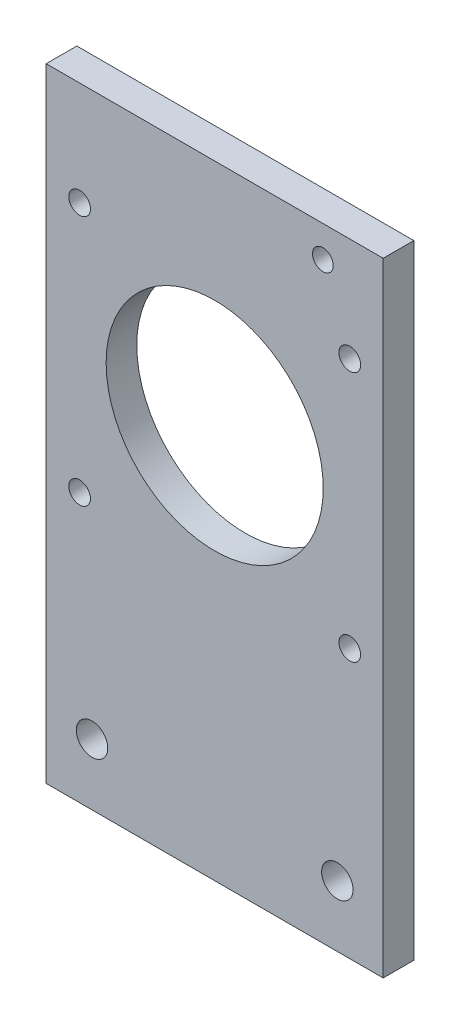
ISO-10303-21;
HEADER;
FILE_DESCRIPTION(('STEP AP214'),'2;1');
FILE_NAME('part.step','',(''),(''),'','','');
FILE_SCHEMA(('AUTOMOTIVE_DESIGN { 1 0 10303 214 1 1 1 1 }'));
ENDSEC;
DATA;
#1=APPLICATION_CONTEXT('core data for automotive mechanical design processes');
#2=APPLICATION_PROTOCOL_DEFINITION('international standard','automotive_design',2000,#1);
#3=PRODUCT_CONTEXT('',#1,'mechanical');
#4=PRODUCT('Part','Part','',(#3));
#5=PRODUCT_RELATED_PRODUCT_CATEGORY('part','',(#4));
#6=PRODUCT_DEFINITION_FORMATION('','',#4);
#7=PRODUCT_DEFINITION_CONTEXT('part definition',#1,'design');
#8=PRODUCT_DEFINITION('design','',#6,#7);
#9=PRODUCT_DEFINITION_SHAPE('','',#8);
#10=(LENGTH_UNIT() NAMED_UNIT(*) SI_UNIT(.MILLI.,.METRE.));
#11=(NAMED_UNIT(*) PLANE_ANGLE_UNIT() SI_UNIT($,.RADIAN.));
#12=(NAMED_UNIT(*) SI_UNIT($,.STERADIAN.) SOLID_ANGLE_UNIT());
#13=UNCERTAINTY_MEASURE_WITH_UNIT(LENGTH_MEASURE(1.E-05),#10,'distance_accuracy_value','');
#14=(GEOMETRIC_REPRESENTATION_CONTEXT(3) GLOBAL_UNCERTAINTY_ASSIGNED_CONTEXT((#13)) GLOBAL_UNIT_ASSIGNED_CONTEXT((#10,
#11,#12)) REPRESENTATION_CONTEXT('',''));
#15=CARTESIAN_POINT('',(0.,0.,0.));
#16=DIRECTION('',(0.,0.,1.));
#17=DIRECTION('',(1.,0.,0.));
#18=AXIS2_PLACEMENT_3D('',#15,#16,#17);
#19=CARTESIAN_POINT('',(0.,0.,3.175));
#20=DIRECTION('',(0.,0.,1.));
#21=DIRECTION('',(1.,0.,0.));
#22=AXIS2_PLACEMENT_3D('',#19,#20,#21);
#23=PLANE('',#22);
#24=CARTESIAN_POINT('',(-28.,107.7,3.175));
#25=DIRECTION('',(0.,0.,-1.));
#26=DIRECTION('',(-1.,0.,0.));
#27=AXIS2_PLACEMENT_3D('',#24,#25,#26);
#28=CIRCLE('',#27,2.25);
#29=CARTESIAN_POINT('',(-30.25,107.7,3.175));
#30=VERTEX_POINT('',#29);
#31=EDGE_CURVE('E189',#30,#30,#28,.T.);
#32=ORIENTED_EDGE('',*,*,#31,.T.);
#33=EDGE_LOOP('',(#32));
#34=FACE_BOUND('',#33,.T.);
#35=CARTESIAN_POINT('',(28.,55.7,3.175));
#36=DIRECTION('',(0.,0.,-1.));
#37=DIRECTION('',(-1.,0.,0.));
#38=AXIS2_PLACEMENT_3D('',#35,#36,#37);
#39=CIRCLE('',#38,2.25000000000001);
#40=CARTESIAN_POINT('',(25.75,55.7,3.175));
#41=VERTEX_POINT('',#40);
#42=EDGE_CURVE('E190',#41,#41,#39,.T.);
#43=ORIENTED_EDGE('',*,*,#42,.T.);
#44=EDGE_LOOP('',(#43));
#45=FACE_BOUND('',#44,.T.);
#46=CARTESIAN_POINT('',(-28.,55.7,3.175));
#47=DIRECTION('',(0.,0.,-1.));
#48=DIRECTION('',(-1.,0.,0.));
#49=AXIS2_PLACEMENT_3D('',#46,#47,#48);
#50=CIRCLE('',#49,2.25);
#51=CARTESIAN_POINT('',(-30.25,55.7,3.175));
#52=VERTEX_POINT('',#51);
#53=EDGE_CURVE('E194',#52,#52,#50,.T.);
#54=ORIENTED_EDGE('',*,*,#53,.T.);
#55=EDGE_LOOP('',(#54));
#56=FACE_BOUND('',#55,.T.);
#57=CARTESIAN_POINT('',(28.,107.7,3.175));
#58=DIRECTION('',(0.,0.,-1.));
#59=DIRECTION('',(-1.,0.,0.));
#60=AXIS2_PLACEMENT_3D('',#57,#58,#59);
#61=CIRCLE('',#60,2.25000000000001);
#62=CARTESIAN_POINT('',(25.75,107.7,3.175));
#63=VERTEX_POINT('',#62);
#64=EDGE_CURVE('E137',#63,#63,#61,.T.);
#65=ORIENTED_EDGE('',*,*,#64,.T.);
#66=EDGE_LOOP('',(#65));
#67=FACE_BOUND('',#66,.T.);
#68=CARTESIAN_POINT('',(-25.425,12.7,3.175));
#69=DIRECTION('',(0.,0.,1.));
#70=DIRECTION('',(1.,0.,0.));
#71=AXIS2_PLACEMENT_3D('',#68,#69,#70);
#72=CIRCLE('',#71,3.25755);
#73=CARTESIAN_POINT('',(-22.16745,12.7,3.175));
#74=VERTEX_POINT('',#73);
#75=EDGE_CURVE('E170',#74,#74,#72,.T.);
#76=ORIENTED_EDGE('',*,*,#75,.F.);
#77=EDGE_LOOP('',(#76));
#78=FACE_BOUND('',#77,.T.);
#79=CARTESIAN_POINT('',(25.425,12.7,3.175));
#80=DIRECTION('',(0.,0.,1.));
#81=DIRECTION('',(1.,0.,0.));
#82=AXIS2_PLACEMENT_3D('',#79,#80,#81);
#83=CIRCLE('',#82,3.25755);
#84=CARTESIAN_POINT('',(28.68255,12.7,3.175));
#85=VERTEX_POINT('',#84);
#86=EDGE_CURVE('E166',#85,#85,#83,.T.);
#87=ORIENTED_EDGE('',*,*,#86,.F.);
#88=EDGE_LOOP('',(#87));
#89=FACE_BOUND('',#88,.T.);
#90=CARTESIAN_POINT('',(22.425,122.7,3.175));
#91=DIRECTION('',(0.,0.,1.));
#92=DIRECTION('',(1.,0.,0.));
#93=AXIS2_PLACEMENT_3D('',#90,#91,#92);
#94=CIRCLE('',#93,2.15);
#95=CARTESIAN_POINT('',(24.575,122.7,3.175));
#96=VERTEX_POINT('',#95);
#97=EDGE_CURVE('E162',#96,#96,#94,.T.);
#98=ORIENTED_EDGE('',*,*,#97,.F.);
#99=EDGE_LOOP('',(#98));
#100=FACE_BOUND('',#99,.T.);
#101=DIRECTION('',(0.,-1.,0.));
#102=VECTOR('',#101,1.);
#103=CARTESIAN_POINT('',(-34.925,0.,3.175));
#104=LINE('',#103,#102);
#105=CARTESIAN_POINT('',(-34.925,129.2,3.175));
#106=VERTEX_POINT('',#105);
#107=CARTESIAN_POINT('',(-34.925,0.,3.175));
#108=VERTEX_POINT('',#107);
#109=EDGE_CURVE('E65',#106,#108,#104,.T.);
#110=ORIENTED_EDGE('',*,*,#109,.T.);
#111=DIRECTION('',(1.,0.,0.));
#112=VECTOR('',#111,1.);
#113=CARTESIAN_POINT('',(-34.925,0.,3.175));
#114=LINE('',#113,#112);
#115=CARTESIAN_POINT('',(34.925,0.,3.175));
#116=VERTEX_POINT('',#115);
#117=EDGE_CURVE('E96',#108,#116,#114,.T.);
#118=ORIENTED_EDGE('',*,*,#117,.T.);
#119=DIRECTION('',(0.,1.,0.));
#120=VECTOR('',#119,1.);
#121=CARTESIAN_POINT('',(34.925,0.,3.175));
#122=LINE('',#121,#120);
#123=CARTESIAN_POINT('',(34.925,129.2,3.175));
#124=VERTEX_POINT('',#123);
#125=EDGE_CURVE('E100',#116,#124,#122,.T.);
#126=ORIENTED_EDGE('',*,*,#125,.T.);
#127=DIRECTION('',(-1.,0.,0.));
#128=VECTOR('',#127,1.);
#129=CARTESIAN_POINT('',(34.925,129.2,3.175));
#130=LINE('',#129,#128);
#131=EDGE_CURVE('E111',#124,#106,#130,.T.);
#132=ORIENTED_EDGE('',*,*,#131,.T.);
#133=EDGE_LOOP('',(#110,#118,#126,#132));
#134=FACE_BOUND('',#133,.T.);
#135=CARTESIAN_POINT('',(0.,81.7,3.175));
#136=DIRECTION('',(0.,0.,1.));
#137=DIRECTION('',(1.,0.,0.));
#138=AXIS2_PLACEMENT_3D('',#135,#136,#137);
#139=CIRCLE('',#138,22.5);
#140=CARTESIAN_POINT('',(22.5,81.7,3.175));
#141=VERTEX_POINT('',#140);
#142=EDGE_CURVE('E120',#141,#141,#139,.T.);
#143=ORIENTED_EDGE('',*,*,#142,.F.);
#144=EDGE_LOOP('',(#143));
#145=FACE_BOUND('',#144,.T.);
#146=ADVANCED_FACE('F45',(#34,#45,#56,#67,#78,#89,#100,#134,#145),#23,.T.);
#147=CARTESIAN_POINT('',(0.,0.,-3.175));
#148=DIRECTION('',(0.,0.,1.));
#149=DIRECTION('',(1.,0.,0.));
#150=AXIS2_PLACEMENT_3D('',#147,#148,#149);
#151=PLANE('',#150);
#152=CARTESIAN_POINT('',(-28.,107.7,-3.175));
#153=DIRECTION('',(0.,0.,1.));
#154=DIRECTION('',(1.,0.,0.));
#155=AXIS2_PLACEMENT_3D('',#152,#153,#154);
#156=CIRCLE('',#155,2.25);
#157=CARTESIAN_POINT('',(-25.75,107.7,-3.175));
#158=VERTEX_POINT('',#157);
#159=EDGE_CURVE('E49',#158,#158,#156,.T.);
#160=ORIENTED_EDGE('',*,*,#159,.T.);
#161=EDGE_LOOP('',(#160));
#162=FACE_BOUND('',#161,.T.);
#163=CARTESIAN_POINT('',(28.,55.7,-3.175));
#164=DIRECTION('',(0.,0.,1.));
#165=DIRECTION('',(1.,0.,0.));
#166=AXIS2_PLACEMENT_3D('',#163,#164,#165);
#167=CIRCLE('',#166,2.25000000000001);
#168=CARTESIAN_POINT('',(30.25,55.7,-3.175));
#169=VERTEX_POINT('',#168);
#170=EDGE_CURVE('E140',#169,#169,#167,.T.);
#171=ORIENTED_EDGE('',*,*,#170,.T.);
#172=EDGE_LOOP('',(#171));
#173=FACE_BOUND('',#172,.T.);
#174=CARTESIAN_POINT('',(-28.,55.7,-3.175));
#175=DIRECTION('',(0.,0.,1.));
#176=DIRECTION('',(1.,0.,0.));
#177=AXIS2_PLACEMENT_3D('',#174,#175,#176);
#178=CIRCLE('',#177,2.25);
#179=CARTESIAN_POINT('',(-25.75,55.7,-3.175));
#180=VERTEX_POINT('',#179);
#181=EDGE_CURVE('E136',#180,#180,#178,.T.);
#182=ORIENTED_EDGE('',*,*,#181,.T.);
#183=EDGE_LOOP('',(#182));
#184=FACE_BOUND('',#183,.T.);
#185=CARTESIAN_POINT('',(28.,107.7,-3.175));
#186=DIRECTION('',(0.,0.,1.));
#187=DIRECTION('',(1.,0.,0.));
#188=AXIS2_PLACEMENT_3D('',#185,#186,#187);
#189=CIRCLE('',#188,2.25000000000001);
#190=CARTESIAN_POINT('',(30.25,107.7,-3.175));
#191=VERTEX_POINT('',#190);
#192=EDGE_CURVE('E132',#191,#191,#189,.T.);
#193=ORIENTED_EDGE('',*,*,#192,.T.);
#194=EDGE_LOOP('',(#193));
#195=FACE_BOUND('',#194,.T.);
#196=CARTESIAN_POINT('',(-25.425,12.7,-3.175));
#197=DIRECTION('',(0.,0.,1.));
#198=DIRECTION('',(1.,0.,0.));
#199=AXIS2_PLACEMENT_3D('',#196,#197,#198);
#200=CIRCLE('',#199,3.25755);
#201=CARTESIAN_POINT('',(-22.16745,12.7,-3.175));
#202=VERTEX_POINT('',#201);
#203=EDGE_CURVE('E158',#202,#202,#200,.T.);
#204=ORIENTED_EDGE('',*,*,#203,.T.);
#205=EDGE_LOOP('',(#204));
#206=FACE_BOUND('',#205,.T.);
#207=CARTESIAN_POINT('',(25.425,12.7,-3.175));
#208=DIRECTION('',(0.,0.,1.));
#209=DIRECTION('',(1.,0.,0.));
#210=AXIS2_PLACEMENT_3D('',#207,#208,#209);
#211=CIRCLE('',#210,3.25755);
#212=CARTESIAN_POINT('',(28.68255,12.7,-3.175));
#213=VERTEX_POINT('',#212);
#214=EDGE_CURVE('E152',#213,#213,#211,.T.);
#215=ORIENTED_EDGE('',*,*,#214,.T.);
#216=EDGE_LOOP('',(#215));
#217=FACE_BOUND('',#216,.T.);
#218=CARTESIAN_POINT('',(22.425,122.7,-3.175));
#219=DIRECTION('',(0.,0.,1.));
#220=DIRECTION('',(1.,0.,0.));
#221=AXIS2_PLACEMENT_3D('',#218,#219,#220);
#222=CIRCLE('',#221,2.15);
#223=CARTESIAN_POINT('',(24.575,122.7,-3.175));
#224=VERTEX_POINT('',#223);
#225=EDGE_CURVE('E147',#224,#224,#222,.T.);
#226=ORIENTED_EDGE('',*,*,#225,.T.);
#227=EDGE_LOOP('',(#226));
#228=FACE_BOUND('',#227,.T.);
#229=DIRECTION('',(1.,0.,0.));
#230=VECTOR('',#229,1.);
#231=CARTESIAN_POINT('',(-34.925,0.,-3.175));
#232=LINE('',#231,#230);
#233=CARTESIAN_POINT('',(-34.925,0.,-3.175));
#234=VERTEX_POINT('',#233);
#235=CARTESIAN_POINT('',(34.925,0.,-3.175));
#236=VERTEX_POINT('',#235);
#237=EDGE_CURVE('E104',#234,#236,#232,.T.);
#238=ORIENTED_EDGE('',*,*,#237,.F.);
#239=DIRECTION('',(0.,-1.,0.));
#240=VECTOR('',#239,1.);
#241=CARTESIAN_POINT('',(-34.925,114.2,-3.175));
#242=LINE('',#241,#240);
#243=CARTESIAN_POINT('',(-34.925,129.2,-3.175));
#244=VERTEX_POINT('',#243);
#245=EDGE_CURVE('E89',#244,#234,#242,.T.);
#246=ORIENTED_EDGE('',*,*,#245,.F.);
#247=DIRECTION('',(-1.,0.,0.));
#248=VECTOR('',#247,1.);
#249=CARTESIAN_POINT('',(34.925,129.2,-3.175));
#250=LINE('',#249,#248);
#251=CARTESIAN_POINT('',(34.925,129.2,-3.175));
#252=VERTEX_POINT('',#251);
#253=EDGE_CURVE('E123',#252,#244,#250,.T.);
#254=ORIENTED_EDGE('',*,*,#253,.F.);
#255=DIRECTION('',(0.,1.,0.));
#256=VECTOR('',#255,1.);
#257=CARTESIAN_POINT('',(34.925,114.2,-3.175));
#258=LINE('',#257,#256);
#259=EDGE_CURVE('E82',#236,#252,#258,.T.);
#260=ORIENTED_EDGE('',*,*,#259,.F.);
#261=EDGE_LOOP('',(#238,#246,#254,#260));
#262=FACE_BOUND('',#261,.T.);
#263=CARTESIAN_POINT('',(0.,81.7,-3.175));
#264=DIRECTION('',(0.,0.,1.));
#265=DIRECTION('',(1.,0.,0.));
#266=AXIS2_PLACEMENT_3D('',#263,#264,#265);
#267=CIRCLE('',#266,22.5);
#268=CARTESIAN_POINT('',(22.5,81.7,-3.175));
#269=VERTEX_POINT('',#268);
#270=EDGE_CURVE('E174',#269,#269,#267,.T.);
#271=ORIENTED_EDGE('',*,*,#270,.T.);
#272=EDGE_LOOP('',(#271));
#273=FACE_BOUND('',#272,.T.);
#274=ADVANCED_FACE('F212',(#162,#173,#184,#195,#206,#217,#228,#262,#273),#151,.F.);
#275=CARTESIAN_POINT('',(-34.925,0.,3.175));
#276=DIRECTION('',(0.,1.,0.));
#277=DIRECTION('',(-1.,0.,0.));
#278=AXIS2_PLACEMENT_3D('',#275,#276,#277);
#279=PLANE('',#278);
#280=ORIENTED_EDGE('',*,*,#237,.T.);
#281=DIRECTION('',(0.,0.,-1.));
#282=VECTOR('',#281,1.);
#283=CARTESIAN_POINT('',(34.925,0.,3.175));
#284=LINE('',#283,#282);
#285=EDGE_CURVE('E56',#116,#236,#284,.T.);
#286=ORIENTED_EDGE('',*,*,#285,.F.);
#287=ORIENTED_EDGE('',*,*,#117,.F.);
#288=DIRECTION('',(0.,0.,-1.));
#289=VECTOR('',#288,1.);
#290=CARTESIAN_POINT('',(-34.925,0.,3.175));
#291=LINE('',#290,#289);
#292=EDGE_CURVE('E11',#108,#234,#291,.T.);
#293=ORIENTED_EDGE('',*,*,#292,.T.);
#294=EDGE_LOOP('',(#280,#286,#287,#293));
#295=FACE_BOUND('',#294,.T.);
#296=ADVANCED_FACE('F47',(#295),#279,.F.);
#297=CARTESIAN_POINT('',(34.925,114.2,3.175));
#298=DIRECTION('',(-1.,0.,0.));
#299=DIRECTION('',(0.,0.,1.));
#300=AXIS2_PLACEMENT_3D('',#297,#298,#299);
#301=PLANE('',#300);
#302=ORIENTED_EDGE('',*,*,#259,.T.);
#303=DIRECTION('',(0.,0.,-1.));
#304=VECTOR('',#303,1.);
#305=CARTESIAN_POINT('',(34.925,129.2,3.175));
#306=LINE('',#305,#304);
#307=EDGE_CURVE('E106',#124,#252,#306,.T.);
#308=ORIENTED_EDGE('',*,*,#307,.F.);
#309=ORIENTED_EDGE('',*,*,#125,.F.);
#310=ORIENTED_EDGE('',*,*,#285,.T.);
#311=EDGE_LOOP('',(#302,#308,#309,#310));
#312=FACE_BOUND('',#311,.T.);
#313=ADVANCED_FACE('F108',(#312),#301,.F.);
#314=CARTESIAN_POINT('',(34.925,129.2,3.175));
#315=DIRECTION('',(0.,-1.,0.));
#316=DIRECTION('',(0.,0.,-1.));
#317=AXIS2_PLACEMENT_3D('',#314,#315,#316);
#318=PLANE('',#317);
#319=ORIENTED_EDGE('',*,*,#253,.T.);
#320=DIRECTION('',(0.,0.,-1.));
#321=VECTOR('',#320,1.);
#322=CARTESIAN_POINT('',(-34.925,129.2,3.175));
#323=LINE('',#322,#321);
#324=EDGE_CURVE('E114',#106,#244,#323,.T.);
#325=ORIENTED_EDGE('',*,*,#324,.F.);
#326=ORIENTED_EDGE('',*,*,#131,.F.);
#327=ORIENTED_EDGE('',*,*,#307,.T.);
#328=EDGE_LOOP('',(#319,#325,#326,#327));
#329=FACE_BOUND('',#328,.T.);
#330=ADVANCED_FACE('F235',(#329),#318,.F.);
#331=CARTESIAN_POINT('',(-34.925,114.2,3.175));
#332=DIRECTION('',(1.,0.,0.));
#333=DIRECTION('',(0.,1.,0.));
#334=AXIS2_PLACEMENT_3D('',#331,#332,#333);
#335=PLANE('',#334);
#336=ORIENTED_EDGE('',*,*,#245,.T.);
#337=ORIENTED_EDGE('',*,*,#292,.F.);
#338=ORIENTED_EDGE('',*,*,#109,.F.);
#339=ORIENTED_EDGE('',*,*,#324,.T.);
#340=EDGE_LOOP('',(#336,#337,#338,#339));
#341=FACE_BOUND('',#340,.T.);
#342=ADVANCED_FACE('F225',(#341),#335,.F.);
#343=CARTESIAN_POINT('',(0.,81.7,3.175));
#344=DIRECTION('',(0.,0.,-1.));
#345=DIRECTION('',(-1.,0.,0.));
#346=AXIS2_PLACEMENT_3D('',#343,#344,#345);
#347=CYLINDRICAL_SURFACE('',#346,22.5);
#348=ORIENTED_EDGE('',*,*,#142,.T.);
#349=EDGE_LOOP('',(#348));
#350=FACE_BOUND('',#349,.T.);
#351=ORIENTED_EDGE('',*,*,#270,.F.);
#352=EDGE_LOOP('',(#351));
#353=FACE_BOUND('',#352,.T.);
#354=ADVANCED_FACE('F222',(#350,#353),#347,.F.);
#355=CARTESIAN_POINT('',(22.425,122.7,-3.175));
#356=DIRECTION('',(0.,0.,1.));
#357=DIRECTION('',(1.,0.,0.));
#358=AXIS2_PLACEMENT_3D('',#355,#356,#357);
#359=CYLINDRICAL_SURFACE('',#358,2.15);
#360=ORIENTED_EDGE('',*,*,#97,.T.);
#361=EDGE_LOOP('',(#360));
#362=FACE_BOUND('',#361,.T.);
#363=ORIENTED_EDGE('',*,*,#225,.F.);
#364=EDGE_LOOP('',(#363));
#365=FACE_BOUND('',#364,.T.);
#366=ADVANCED_FACE('F224',(#362,#365),#359,.F.);
#367=CARTESIAN_POINT('',(25.425,12.7,-3.175));
#368=DIRECTION('',(0.,0.,1.));
#369=DIRECTION('',(1.,0.,0.));
#370=AXIS2_PLACEMENT_3D('',#367,#368,#369);
#371=CYLINDRICAL_SURFACE('',#370,3.25755);
#372=ORIENTED_EDGE('',*,*,#86,.T.);
#373=EDGE_LOOP('',(#372));
#374=FACE_BOUND('',#373,.T.);
#375=ORIENTED_EDGE('',*,*,#214,.F.);
#376=EDGE_LOOP('',(#375));
#377=FACE_BOUND('',#376,.T.);
#378=ADVANCED_FACE('F232',(#374,#377),#371,.F.);
#379=CARTESIAN_POINT('',(-25.425,12.7,-3.175));
#380=DIRECTION('',(0.,0.,1.));
#381=DIRECTION('',(1.,0.,0.));
#382=AXIS2_PLACEMENT_3D('',#379,#380,#381);
#383=CYLINDRICAL_SURFACE('',#382,3.25755);
#384=ORIENTED_EDGE('',*,*,#75,.T.);
#385=EDGE_LOOP('',(#384));
#386=FACE_BOUND('',#385,.T.);
#387=ORIENTED_EDGE('',*,*,#203,.F.);
#388=EDGE_LOOP('',(#387));
#389=FACE_BOUND('',#388,.T.);
#390=ADVANCED_FACE('F305',(#386,#389),#383,.F.);
#391=CARTESIAN_POINT('',(28.,107.7,3.175));
#392=DIRECTION('',(0.,0.,-1.));
#393=DIRECTION('',(-1.,0.,0.));
#394=AXIS2_PLACEMENT_3D('',#391,#392,#393);
#395=CYLINDRICAL_SURFACE('',#394,2.25000000000001);
#396=ORIENTED_EDGE('',*,*,#64,.F.);
#397=EDGE_LOOP('',(#396));
#398=FACE_BOUND('',#397,.T.);
#399=ORIENTED_EDGE('',*,*,#192,.F.);
#400=EDGE_LOOP('',(#399));
#401=FACE_BOUND('',#400,.T.);
#402=ADVANCED_FACE('F208',(#398,#401),#395,.F.);
#403=CARTESIAN_POINT('',(-28.,55.7,3.175));
#404=DIRECTION('',(0.,0.,-1.));
#405=DIRECTION('',(-1.,0.,0.));
#406=AXIS2_PLACEMENT_3D('',#403,#404,#405);
#407=CYLINDRICAL_SURFACE('',#406,2.25);
#408=ORIENTED_EDGE('',*,*,#53,.F.);
#409=EDGE_LOOP('',(#408));
#410=FACE_BOUND('',#409,.T.);
#411=ORIENTED_EDGE('',*,*,#181,.F.);
#412=EDGE_LOOP('',(#411));
#413=FACE_BOUND('',#412,.T.);
#414=ADVANCED_FACE('F204',(#410,#413),#407,.F.);
#415=CARTESIAN_POINT('',(28.,55.7,3.175));
#416=DIRECTION('',(0.,0.,-1.));
#417=DIRECTION('',(-1.,0.,0.));
#418=AXIS2_PLACEMENT_3D('',#415,#416,#417);
#419=CYLINDRICAL_SURFACE('',#418,2.25000000000001);
#420=ORIENTED_EDGE('',*,*,#42,.F.);
#421=EDGE_LOOP('',(#420));
#422=FACE_BOUND('',#421,.T.);
#423=ORIENTED_EDGE('',*,*,#170,.F.);
#424=EDGE_LOOP('',(#423));
#425=FACE_BOUND('',#424,.T.);
#426=ADVANCED_FACE('F207',(#422,#425),#419,.F.);
#427=CARTESIAN_POINT('',(-28.,107.7,3.175));
#428=DIRECTION('',(0.,0.,-1.));
#429=DIRECTION('',(-1.,0.,0.));
#430=AXIS2_PLACEMENT_3D('',#427,#428,#429);
#431=CYLINDRICAL_SURFACE('',#430,2.25);
#432=ORIENTED_EDGE('',*,*,#31,.F.);
#433=EDGE_LOOP('',(#432));
#434=FACE_BOUND('',#433,.T.);
#435=ORIENTED_EDGE('',*,*,#159,.F.);
#436=EDGE_LOOP('',(#435));
#437=FACE_BOUND('',#436,.T.);
#438=ADVANCED_FACE('F338',(#434,#437),#431,.F.);
#439=CLOSED_SHELL('',(#146,#274,#296,#313,#330,#342,#354,#366,#378,#390,#402,#414,#426,#438));
#440=MANIFOLD_SOLID_BREP('B2',#439);
#441=ADVANCED_BREP_SHAPE_REPRESENTATION('',(#18,#440),#14);
#442=SHAPE_DEFINITION_REPRESENTATION(#9,#441);
ENDSEC;
END-ISO-10303-21;
